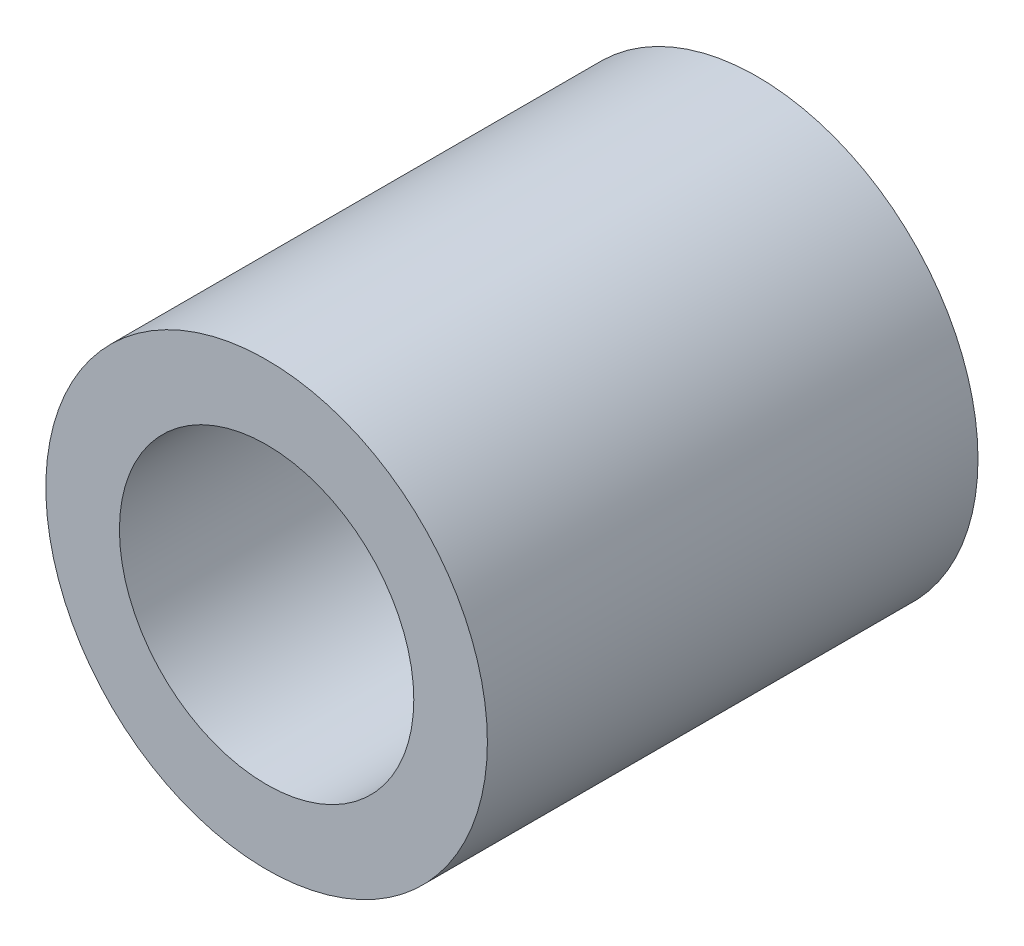
ISO-10303-21;
HEADER;
FILE_DESCRIPTION(('STEP AP214'),'2;1');
FILE_NAME('part.step','',(''),(''),'','','');
FILE_SCHEMA(('AUTOMOTIVE_DESIGN { 1 0 10303 214 1 1 1 1 }'));
ENDSEC;
DATA;
#1=APPLICATION_CONTEXT('core data for automotive mechanical design processes');
#2=APPLICATION_PROTOCOL_DEFINITION('international standard','automotive_design',2000,#1);
#3=PRODUCT_CONTEXT('',#1,'mechanical');
#4=PRODUCT('Part','Part','',(#3));
#5=PRODUCT_RELATED_PRODUCT_CATEGORY('part','',(#4));
#6=PRODUCT_DEFINITION_FORMATION('','',#4);
#7=PRODUCT_DEFINITION_CONTEXT('part definition',#1,'design');
#8=PRODUCT_DEFINITION('design','',#6,#7);
#9=PRODUCT_DEFINITION_SHAPE('','',#8);
#10=(LENGTH_UNIT() NAMED_UNIT(*) SI_UNIT(.MILLI.,.METRE.));
#11=(NAMED_UNIT(*) PLANE_ANGLE_UNIT() SI_UNIT($,.RADIAN.));
#12=(NAMED_UNIT(*) SI_UNIT($,.STERADIAN.) SOLID_ANGLE_UNIT());
#13=UNCERTAINTY_MEASURE_WITH_UNIT(LENGTH_MEASURE(1.E-05),#10,'distance_accuracy_value','');
#14=(GEOMETRIC_REPRESENTATION_CONTEXT(3) GLOBAL_UNCERTAINTY_ASSIGNED_CONTEXT((#13)) GLOBAL_UNIT_ASSIGNED_CONTEXT((#10,
#11,#12)) REPRESENTATION_CONTEXT('',''));
#15=CARTESIAN_POINT('',(0.,0.,0.));
#16=DIRECTION('',(0.,0.,1.));
#17=DIRECTION('',(1.,0.,0.));
#18=AXIS2_PLACEMENT_3D('',#15,#16,#17);
#19=CARTESIAN_POINT('',(0.,0.,2.5));
#20=DIRECTION('',(0.,0.,1.));
#21=DIRECTION('',(1.,0.,0.));
#22=AXIS2_PLACEMENT_3D('',#19,#20,#21);
#23=PLANE('',#22);
#24=CARTESIAN_POINT('',(0.,0.,2.5));
#25=DIRECTION('',(0.,0.,1.));
#26=DIRECTION('',(1.,0.,0.));
#27=AXIS2_PLACEMENT_3D('',#24,#25,#26);
#28=CIRCLE('',#27,2.25);
#29=CARTESIAN_POINT('',(2.25000000000001,0.,2.5));
#30=VERTEX_POINT('',#29);
#31=EDGE_CURVE('E10',#30,#30,#28,.T.);
#32=ORIENTED_EDGE('',*,*,#31,.T.);
#33=EDGE_LOOP('',(#32));
#34=FACE_BOUND('',#33,.T.);
#35=CARTESIAN_POINT('',(0.,0.,2.5));
#36=DIRECTION('',(0.,0.,1.));
#37=DIRECTION('',(1.,0.,0.));
#38=AXIS2_PLACEMENT_3D('',#35,#36,#37);
#39=CIRCLE('',#38,1.5);
#40=CARTESIAN_POINT('',(1.50000000000001,0.,2.5));
#41=VERTEX_POINT('',#40);
#42=EDGE_CURVE('E46',#41,#41,#39,.T.);
#43=ORIENTED_EDGE('',*,*,#42,.F.);
#44=EDGE_LOOP('',(#43));
#45=FACE_BOUND('',#44,.T.);
#46=ADVANCED_FACE('F32',(#34,#45),#23,.T.);
#47=CARTESIAN_POINT('',(0.,0.,-2.5));
#48=DIRECTION('',(0.,0.,1.));
#49=DIRECTION('',(1.,0.,0.));
#50=AXIS2_PLACEMENT_3D('',#47,#48,#49);
#51=PLANE('',#50);
#52=CARTESIAN_POINT('',(0.,0.,-2.5));
#53=DIRECTION('',(0.,0.,1.));
#54=DIRECTION('',(1.,0.,0.));
#55=AXIS2_PLACEMENT_3D('',#52,#53,#54);
#56=CIRCLE('',#55,2.25);
#57=CARTESIAN_POINT('',(2.24999999999994,0.,-2.5));
#58=VERTEX_POINT('',#57);
#59=EDGE_CURVE('E36',#58,#58,#56,.T.);
#60=ORIENTED_EDGE('',*,*,#59,.F.);
#61=EDGE_LOOP('',(#60));
#62=FACE_BOUND('',#61,.T.);
#63=CARTESIAN_POINT('',(0.,0.,-2.5));
#64=DIRECTION('',(0.,0.,1.));
#65=DIRECTION('',(1.,0.,0.));
#66=AXIS2_PLACEMENT_3D('',#63,#64,#65);
#67=CIRCLE('',#66,1.5);
#68=CARTESIAN_POINT('',(1.49999999999994,0.,-2.5));
#69=VERTEX_POINT('',#68);
#70=EDGE_CURVE('E48',#69,#69,#67,.T.);
#71=ORIENTED_EDGE('',*,*,#70,.T.);
#72=EDGE_LOOP('',(#71));
#73=FACE_BOUND('',#72,.T.);
#74=ADVANCED_FACE('F61',(#62,#73),#51,.F.);
#75=CARTESIAN_POINT('',(0.,0.,2.5));
#76=DIRECTION('',(0.,0.,-1.));
#77=DIRECTION('',(-1.,0.,0.));
#78=AXIS2_PLACEMENT_3D('',#75,#76,#77);
#79=CYLINDRICAL_SURFACE('',#78,2.25);
#80=ORIENTED_EDGE('',*,*,#31,.F.);
#81=EDGE_LOOP('',(#80));
#82=FACE_BOUND('',#81,.T.);
#83=ORIENTED_EDGE('',*,*,#59,.T.);
#84=EDGE_LOOP('',(#83));
#85=FACE_BOUND('',#84,.T.);
#86=ADVANCED_FACE('F34',(#82,#85),#79,.T.);
#87=CARTESIAN_POINT('',(0.,0.,2.5));
#88=DIRECTION('',(0.,0.,-1.));
#89=DIRECTION('',(-1.,0.,0.));
#90=AXIS2_PLACEMENT_3D('',#87,#88,#89);
#91=CYLINDRICAL_SURFACE('',#90,1.5);
#92=ORIENTED_EDGE('',*,*,#42,.T.);
#93=EDGE_LOOP('',(#92));
#94=FACE_BOUND('',#93,.T.);
#95=ORIENTED_EDGE('',*,*,#70,.F.);
#96=EDGE_LOOP('',(#95));
#97=FACE_BOUND('',#96,.T.);
#98=ADVANCED_FACE('F57',(#94,#97),#91,.F.);
#99=CLOSED_SHELL('',(#46,#74,#86,#98));
#100=MANIFOLD_SOLID_BREP('B2',#99);
#101=ADVANCED_BREP_SHAPE_REPRESENTATION('',(#18,#100),#14);
#102=SHAPE_DEFINITION_REPRESENTATION(#9,#101);
ENDSEC;
END-ISO-10303-21;
